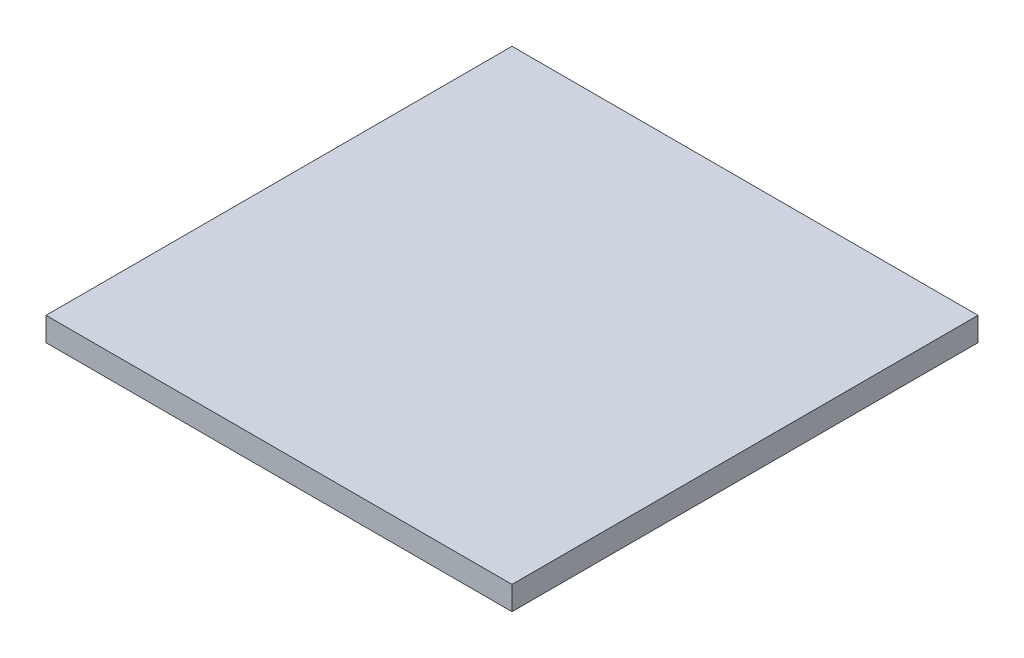
ISO-10303-21;
HEADER;
FILE_DESCRIPTION(('STEP AP214'),'2;1');
FILE_NAME('part.step','',(''),(''),'','','');
FILE_SCHEMA(('AUTOMOTIVE_DESIGN { 1 0 10303 214 1 1 1 1 }'));
ENDSEC;
DATA;
#1=APPLICATION_CONTEXT('core data for automotive mechanical design processes');
#2=APPLICATION_PROTOCOL_DEFINITION('international standard','automotive_design',2000,#1);
#3=PRODUCT_CONTEXT('',#1,'mechanical');
#4=PRODUCT('Part','Part','',(#3));
#5=PRODUCT_RELATED_PRODUCT_CATEGORY('part','',(#4));
#6=PRODUCT_DEFINITION_FORMATION('','',#4);
#7=PRODUCT_DEFINITION_CONTEXT('part definition',#1,'design');
#8=PRODUCT_DEFINITION('design','',#6,#7);
#9=PRODUCT_DEFINITION_SHAPE('','',#8);
#10=(LENGTH_UNIT() NAMED_UNIT(*) SI_UNIT(.MILLI.,.METRE.));
#11=(NAMED_UNIT(*) PLANE_ANGLE_UNIT() SI_UNIT($,.RADIAN.));
#12=(NAMED_UNIT(*) SI_UNIT($,.STERADIAN.) SOLID_ANGLE_UNIT());
#13=UNCERTAINTY_MEASURE_WITH_UNIT(LENGTH_MEASURE(1.E-05),#10,'distance_accuracy_value','');
#14=(GEOMETRIC_REPRESENTATION_CONTEXT(3) GLOBAL_UNCERTAINTY_ASSIGNED_CONTEXT((#13)) GLOBAL_UNIT_ASSIGNED_CONTEXT((#10,
#11,#12)) REPRESENTATION_CONTEXT('',''));
#15=CARTESIAN_POINT('',(0.,0.,0.));
#16=DIRECTION('',(0.,0.,1.));
#17=DIRECTION('',(1.,0.,0.));
#18=AXIS2_PLACEMENT_3D('',#15,#16,#17);
#19=CARTESIAN_POINT('',(-22.2031802120141,1.5,-19.6492932862191));
#20=DIRECTION('',(1.,0.,0.));
#21=DIRECTION('',(0.,0.,-1.));
#22=AXIS2_PLACEMENT_3D('',#19,#20,#21);
#23=PLANE('',#22);
#24=DIRECTION('',(0.,0.,1.));
#25=VECTOR('',#24,1.);
#26=CARTESIAN_POINT('',(-22.2031802120141,0.,-19.6492932862191));
#27=LINE('',#26,#25);
#28=CARTESIAN_POINT('',(-22.2031802120141,0.,-19.6492932862191));
#29=VERTEX_POINT('',#28);
#30=CARTESIAN_POINT('',(-22.2031802120141,0.,9.85070671378092));
#31=VERTEX_POINT('',#30);
#32=EDGE_CURVE('E111',#29,#31,#27,.T.);
#33=ORIENTED_EDGE('',*,*,#32,.T.);
#34=DIRECTION('',(0.,-1.,0.));
#35=VECTOR('',#34,1.);
#36=CARTESIAN_POINT('',(-22.2031802120141,1.5,9.85070671378092));
#37=LINE('',#36,#35);
#38=CARTESIAN_POINT('',(-22.2031802120141,1.5,9.85070671378092));
#39=VERTEX_POINT('',#38);
#40=EDGE_CURVE('E11',#39,#31,#37,.T.);
#41=ORIENTED_EDGE('',*,*,#40,.F.);
#42=DIRECTION('',(0.,0.,1.));
#43=VECTOR('',#42,1.);
#44=CARTESIAN_POINT('',(-22.2031802120141,1.5,-19.6492932862191));
#45=LINE('',#44,#43);
#46=CARTESIAN_POINT('',(-22.2031802120141,1.5,-19.6492932862191));
#47=VERTEX_POINT('',#46);
#48=EDGE_CURVE('E95',#47,#39,#45,.T.);
#49=ORIENTED_EDGE('',*,*,#48,.F.);
#50=DIRECTION('',(0.,-1.,0.));
#51=VECTOR('',#50,1.);
#52=CARTESIAN_POINT('',(-22.2031802120141,1.5,-19.6492932862191));
#53=LINE('',#52,#51);
#54=EDGE_CURVE('E107',#47,#29,#53,.T.);
#55=ORIENTED_EDGE('',*,*,#54,.T.);
#56=EDGE_LOOP('',(#33,#41,#49,#55));
#57=FACE_BOUND('',#56,.T.);
#58=ADVANCED_FACE('F43',(#57),#23,.F.);
#59=CARTESIAN_POINT('',(-22.2031802120141,1.5,9.85070671378092));
#60=DIRECTION('',(0.,0.,-1.));
#61=DIRECTION('',(-1.,0.,0.));
#62=AXIS2_PLACEMENT_3D('',#59,#60,#61);
#63=PLANE('',#62);
#64=DIRECTION('',(1.,0.,0.));
#65=VECTOR('',#64,1.);
#66=CARTESIAN_POINT('',(-22.2031802120141,0.,9.85070671378092));
#67=LINE('',#66,#65);
#68=CARTESIAN_POINT('',(7.29681978798587,0.,9.85070671378092));
#69=VERTEX_POINT('',#68);
#70=EDGE_CURVE('E100',#31,#69,#67,.T.);
#71=ORIENTED_EDGE('',*,*,#70,.T.);
#72=DIRECTION('',(0.,-1.,0.));
#73=VECTOR('',#72,1.);
#74=CARTESIAN_POINT('',(7.29681978798587,1.5,9.85070671378092));
#75=LINE('',#74,#73);
#76=CARTESIAN_POINT('',(7.29681978798587,1.5,9.85070671378092));
#77=VERTEX_POINT('',#76);
#78=EDGE_CURVE('E52',#77,#69,#75,.T.);
#79=ORIENTED_EDGE('',*,*,#78,.F.);
#80=DIRECTION('',(1.,0.,0.));
#81=VECTOR('',#80,1.);
#82=CARTESIAN_POINT('',(-22.2031802120141,1.5,9.85070671378092));
#83=LINE('',#82,#81);
#84=EDGE_CURVE('E90',#39,#77,#83,.T.);
#85=ORIENTED_EDGE('',*,*,#84,.F.);
#86=ORIENTED_EDGE('',*,*,#40,.T.);
#87=EDGE_LOOP('',(#71,#79,#85,#86));
#88=FACE_BOUND('',#87,.T.);
#89=ADVANCED_FACE('F99',(#88),#63,.F.);
#90=CARTESIAN_POINT('',(7.29681978798587,1.5,-19.6492932862191));
#91=DIRECTION('',(-1.,0.,0.));
#92=DIRECTION('',(0.,0.,1.));
#93=AXIS2_PLACEMENT_3D('',#90,#91,#92);
#94=PLANE('',#93);
#95=DIRECTION('',(0.,0.,-1.));
#96=VECTOR('',#95,1.);
#97=CARTESIAN_POINT('',(7.29681978798587,0.,-19.6492932862191));
#98=LINE('',#97,#96);
#99=CARTESIAN_POINT('',(7.29681978798587,0.,-19.6492932862191));
#100=VERTEX_POINT('',#99);
#101=EDGE_CURVE('E77',#69,#100,#98,.T.);
#102=ORIENTED_EDGE('',*,*,#101,.T.);
#103=DIRECTION('',(0.,-1.,0.));
#104=VECTOR('',#103,1.);
#105=CARTESIAN_POINT('',(7.29681978798587,1.5,-19.6492932862191));
#106=LINE('',#105,#104);
#107=CARTESIAN_POINT('',(7.29681978798587,1.5,-19.6492932862191));
#108=VERTEX_POINT('',#107);
#109=EDGE_CURVE('E102',#108,#100,#106,.T.);
#110=ORIENTED_EDGE('',*,*,#109,.F.);
#111=DIRECTION('',(0.,0.,-1.));
#112=VECTOR('',#111,1.);
#113=CARTESIAN_POINT('',(7.29681978798587,1.5,-19.6492932862191));
#114=LINE('',#113,#112);
#115=EDGE_CURVE('E93',#77,#108,#114,.T.);
#116=ORIENTED_EDGE('',*,*,#115,.F.);
#117=ORIENTED_EDGE('',*,*,#78,.T.);
#118=EDGE_LOOP('',(#102,#110,#116,#117));
#119=FACE_BOUND('',#118,.T.);
#120=ADVANCED_FACE('F103',(#119),#94,.F.);
#121=CARTESIAN_POINT('',(-22.2031802120141,1.5,-19.6492932862191));
#122=DIRECTION('',(0.,0.,1.));
#123=DIRECTION('',(1.,0.,0.));
#124=AXIS2_PLACEMENT_3D('',#121,#122,#123);
#125=PLANE('',#124);
#126=DIRECTION('',(-1.,0.,0.));
#127=VECTOR('',#126,1.);
#128=CARTESIAN_POINT('',(-22.2031802120141,0.,-19.6492932862191));
#129=LINE('',#128,#127);
#130=EDGE_CURVE('E83',#100,#29,#129,.T.);
#131=ORIENTED_EDGE('',*,*,#130,.T.);
#132=ORIENTED_EDGE('',*,*,#54,.F.);
#133=DIRECTION('',(-1.,0.,0.));
#134=VECTOR('',#133,1.);
#135=CARTESIAN_POINT('',(-22.2031802120141,1.5,-19.6492932862191));
#136=LINE('',#135,#134);
#137=EDGE_CURVE('E60',#108,#47,#136,.T.);
#138=ORIENTED_EDGE('',*,*,#137,.F.);
#139=ORIENTED_EDGE('',*,*,#109,.T.);
#140=EDGE_LOOP('',(#131,#132,#138,#139));
#141=FACE_BOUND('',#140,.T.);
#142=ADVANCED_FACE('F124',(#141),#125,.F.);
#143=CARTESIAN_POINT('',(0.,1.5,0.));
#144=DIRECTION('',(0.,1.,0.));
#145=DIRECTION('',(0.,0.,1.));
#146=AXIS2_PLACEMENT_3D('',#143,#144,#145);
#147=PLANE('',#146);
#148=ORIENTED_EDGE('',*,*,#48,.T.);
#149=ORIENTED_EDGE('',*,*,#84,.T.);
#150=ORIENTED_EDGE('',*,*,#115,.T.);
#151=ORIENTED_EDGE('',*,*,#137,.T.);
#152=EDGE_LOOP('',(#148,#149,#150,#151));
#153=FACE_BOUND('',#152,.T.);
#154=ADVANCED_FACE('F91',(#153),#147,.T.);
#155=CARTESIAN_POINT('',(0.,0.,0.));
#156=DIRECTION('',(0.,1.,0.));
#157=DIRECTION('',(0.,0.,1.));
#158=AXIS2_PLACEMENT_3D('',#155,#156,#157);
#159=PLANE('',#158);
#160=ORIENTED_EDGE('',*,*,#32,.F.);
#161=ORIENTED_EDGE('',*,*,#130,.F.);
#162=ORIENTED_EDGE('',*,*,#101,.F.);
#163=ORIENTED_EDGE('',*,*,#70,.F.);
#164=EDGE_LOOP('',(#160,#161,#162,#163));
#165=FACE_BOUND('',#164,.T.);
#166=ADVANCED_FACE('F127',(#165),#159,.F.);
#167=CLOSED_SHELL('',(#58,#89,#120,#142,#154,#166));
#168=MANIFOLD_SOLID_BREP('B2',#167);
#169=ADVANCED_BREP_SHAPE_REPRESENTATION('',(#18,#168),#14);
#170=SHAPE_DEFINITION_REPRESENTATION(#9,#169);
ENDSEC;
END-ISO-10303-21;
